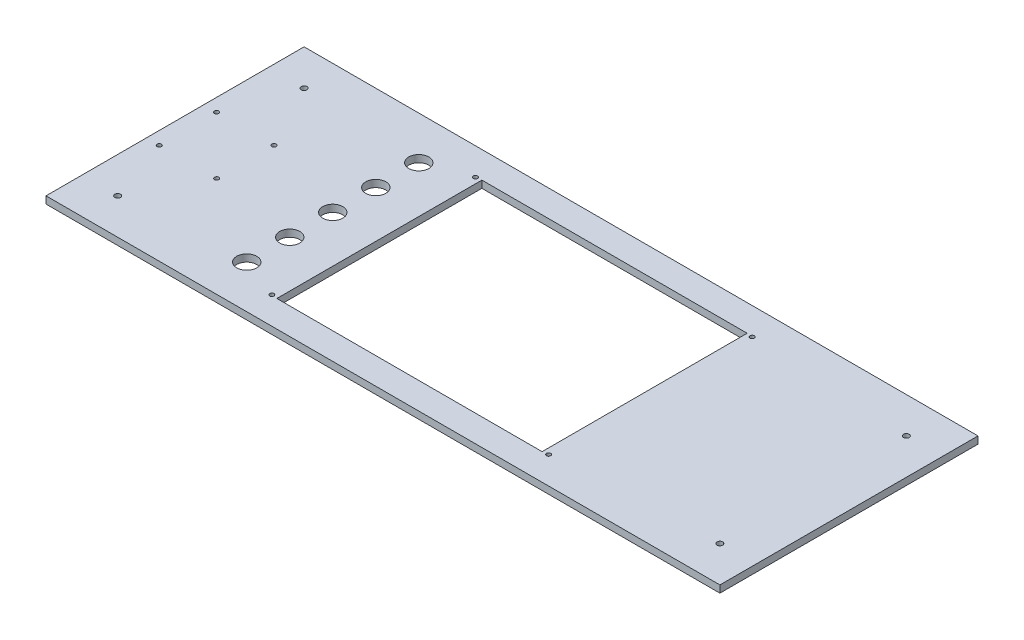
ISO-10303-21;
HEADER;
FILE_DESCRIPTION(('STEP AP214'),'2;1');
FILE_NAME('part.step','',(''),(''),'','','');
FILE_SCHEMA(('AUTOMOTIVE_DESIGN { 1 0 10303 214 1 1 1 1 }'));
ENDSEC;
DATA;
#1=APPLICATION_CONTEXT('core data for automotive mechanical design processes');
#2=APPLICATION_PROTOCOL_DEFINITION('international standard','automotive_design',2000,#1);
#3=PRODUCT_CONTEXT('',#1,'mechanical');
#4=PRODUCT('Part','Part','',(#3));
#5=PRODUCT_RELATED_PRODUCT_CATEGORY('part','',(#4));
#6=PRODUCT_DEFINITION_FORMATION('','',#4);
#7=PRODUCT_DEFINITION_CONTEXT('part definition',#1,'design');
#8=PRODUCT_DEFINITION('design','',#6,#7);
#9=PRODUCT_DEFINITION_SHAPE('','',#8);
#10=(LENGTH_UNIT() NAMED_UNIT(*) SI_UNIT(.MILLI.,.METRE.));
#11=(NAMED_UNIT(*) PLANE_ANGLE_UNIT() SI_UNIT($,.RADIAN.));
#12=(NAMED_UNIT(*) SI_UNIT($,.STERADIAN.) SOLID_ANGLE_UNIT());
#13=UNCERTAINTY_MEASURE_WITH_UNIT(LENGTH_MEASURE(1.E-05),#10,'distance_accuracy_value','');
#14=(GEOMETRIC_REPRESENTATION_CONTEXT(3) GLOBAL_UNCERTAINTY_ASSIGNED_CONTEXT((#13)) GLOBAL_UNIT_ASSIGNED_CONTEXT((#10,
#11,#12)) REPRESENTATION_CONTEXT('',''));
#15=CARTESIAN_POINT('',(0.,0.,0.));
#16=DIRECTION('',(0.,0.,1.));
#17=DIRECTION('',(1.,0.,0.));
#18=AXIS2_PLACEMENT_3D('',#15,#16,#17);
#19=CARTESIAN_POINT('',(0.,5.,0.));
#20=DIRECTION('',(0.,1.,0.));
#21=DIRECTION('',(0.,0.,1.));
#22=AXIS2_PLACEMENT_3D('',#19,#20,#21);
#23=PLANE('',#22);
#24=CARTESIAN_POINT('',(-125.,5.,15.0000000000011));
#25=DIRECTION('',(0.,1.,0.));
#26=DIRECTION('',(0.,0.,1.));
#27=AXIS2_PLACEMENT_3D('',#24,#25,#26);
#28=CIRCLE('',#27,6.99999999999993);
#29=CARTESIAN_POINT('',(-125.,5.,22.000000000001));
#30=VERTEX_POINT('',#29);
#31=EDGE_CURVE('E329',#30,#30,#28,.T.);
#32=ORIENTED_EDGE('',*,*,#31,.F.);
#33=EDGE_LOOP('',(#32));
#34=FACE_BOUND('',#33,.T.);
#35=CARTESIAN_POINT('',(-125.,5.,-45.0000000000011));
#36=DIRECTION('',(0.,1.,0.));
#37=DIRECTION('',(0.,0.,1.));
#38=AXIS2_PLACEMENT_3D('',#35,#36,#37);
#39=CIRCLE('',#38,6.99999999999993);
#40=CARTESIAN_POINT('',(-125.,5.,-38.0000000000011));
#41=VERTEX_POINT('',#40);
#42=EDGE_CURVE('E345',#41,#41,#39,.T.);
#43=ORIENTED_EDGE('',*,*,#42,.F.);
#44=EDGE_LOOP('',(#43));
#45=FACE_BOUND('',#44,.T.);
#46=CARTESIAN_POINT('',(-96.4999999999985,5.,56.));
#47=DIRECTION('',(0.,1.,0.));
#48=DIRECTION('',(0.,0.,1.));
#49=AXIS2_PLACEMENT_3D('',#46,#47,#48);
#50=CIRCLE('',#49,1.5);
#51=CARTESIAN_POINT('',(-96.4999999999985,5.,57.5));
#52=VERTEX_POINT('',#51);
#53=EDGE_CURVE('E361',#52,#52,#50,.T.);
#54=ORIENTED_EDGE('',*,*,#53,.F.);
#55=EDGE_LOOP('',(#54));
#56=FACE_BOUND('',#55,.T.);
#57=CARTESIAN_POINT('',(96.5,5.,-86.));
#58=DIRECTION('',(0.,1.,0.));
#59=DIRECTION('',(0.,0.,1.));
#60=AXIS2_PLACEMENT_3D('',#57,#58,#59);
#61=CIRCLE('',#60,1.5);
#62=CARTESIAN_POINT('',(96.5,5.,-84.5));
#63=VERTEX_POINT('',#62);
#64=EDGE_CURVE('E377',#63,#63,#61,.T.);
#65=ORIENTED_EDGE('',*,*,#64,.F.);
#66=EDGE_LOOP('',(#65));
#67=FACE_BOUND('',#66,.T.);
#68=CARTESIAN_POINT('',(210.,5.,-80.));
#69=DIRECTION('',(0.,1.,0.));
#70=DIRECTION('',(0.,0.,1.));
#71=AXIS2_PLACEMENT_3D('',#68,#69,#70);
#72=CIRCLE('',#71,2.);
#73=CARTESIAN_POINT('',(210.,5.,-78.));
#74=VERTEX_POINT('',#73);
#75=EDGE_CURVE('E393',#74,#74,#72,.T.);
#76=ORIENTED_EDGE('',*,*,#75,.F.);
#77=EDGE_LOOP('',(#76));
#78=FACE_BOUND('',#77,.T.);
#79=CARTESIAN_POINT('',(210.,5.,50.));
#80=DIRECTION('',(0.,1.,0.));
#81=DIRECTION('',(0.,0.,1.));
#82=AXIS2_PLACEMENT_3D('',#79,#80,#81);
#83=CIRCLE('',#82,2.);
#84=CARTESIAN_POINT('',(210.,5.,52.));
#85=VERTEX_POINT('',#84);
#86=EDGE_CURVE('E409',#85,#85,#83,.T.);
#87=ORIENTED_EDGE('',*,*,#86,.F.);
#88=EDGE_LOOP('',(#87));
#89=FACE_BOUND('',#88,.T.);
#90=CARTESIAN_POINT('',(-226.,5.,5.));
#91=DIRECTION('',(0.,1.,0.));
#92=DIRECTION('',(0.,0.,1.));
#93=AXIS2_PLACEMENT_3D('',#90,#91,#92);
#94=CIRCLE('',#93,1.5);
#95=CARTESIAN_POINT('',(-226.,5.,6.5));
#96=VERTEX_POINT('',#95);
#97=EDGE_CURVE('E425',#96,#96,#94,.T.);
#98=ORIENTED_EDGE('',*,*,#97,.F.);
#99=EDGE_LOOP('',(#98));
#100=FACE_BOUND('',#99,.T.);
#101=CARTESIAN_POINT('',(-186.,5.,-35.));
#102=DIRECTION('',(0.,1.,0.));
#103=DIRECTION('',(0.,0.,1.));
#104=AXIS2_PLACEMENT_3D('',#101,#102,#103);
#105=CIRCLE('',#104,1.5);
#106=CARTESIAN_POINT('',(-186.,5.,-33.5));
#107=VERTEX_POINT('',#106);
#108=EDGE_CURVE('E441',#107,#107,#105,.T.);
#109=ORIENTED_EDGE('',*,*,#108,.F.);
#110=EDGE_LOOP('',(#109));
#111=FACE_BOUND('',#110,.T.);
#112=DIRECTION('',(1.,0.,0.));
#113=VECTOR('',#112,1.);
#114=CARTESIAN_POINT('',(-92.5,5.,56.5));
#115=LINE('',#114,#113);
#116=CARTESIAN_POINT('',(-92.5,5.,56.5));
#117=VERTEX_POINT('',#116);
#118=CARTESIAN_POINT('',(92.5,5.,56.5));
#119=VERTEX_POINT('',#118);
#120=EDGE_CURVE('E114',#117,#119,#115,.T.);
#121=ORIENTED_EDGE('',*,*,#120,.F.);
#122=DIRECTION('',(0.,0.,1.));
#123=VECTOR('',#122,1.);
#124=CARTESIAN_POINT('',(-92.5,5.,-86.5));
#125=LINE('',#124,#123);
#126=CARTESIAN_POINT('',(-92.5,5.,-86.5));
#127=VERTEX_POINT('',#126);
#128=EDGE_CURVE('E105',#127,#117,#125,.T.);
#129=ORIENTED_EDGE('',*,*,#128,.F.);
#130=DIRECTION('',(-1.,0.,0.));
#131=VECTOR('',#130,1.);
#132=CARTESIAN_POINT('',(-92.5,5.,-86.5));
#133=LINE('',#132,#131);
#134=CARTESIAN_POINT('',(92.5,5.,-86.5));
#135=VERTEX_POINT('',#134);
#136=EDGE_CURVE('E132',#135,#127,#133,.T.);
#137=ORIENTED_EDGE('',*,*,#136,.F.);
#138=DIRECTION('',(0.,0.,-1.));
#139=VECTOR('',#138,1.);
#140=CARTESIAN_POINT('',(92.5,5.,-86.5));
#141=LINE('',#140,#139);
#142=EDGE_CURVE('E128',#119,#135,#141,.T.);
#143=ORIENTED_EDGE('',*,*,#142,.F.);
#144=EDGE_LOOP('',(#121,#129,#137,#143));
#145=FACE_BOUND('',#144,.T.);
#146=DIRECTION('',(0.,0.,1.));
#147=VECTOR('',#146,1.);
#148=CARTESIAN_POINT('',(-235.,5.,-105.));
#149=LINE('',#148,#147);
#150=CARTESIAN_POINT('',(-235.,5.,-105.));
#151=VERTEX_POINT('',#150);
#152=CARTESIAN_POINT('',(-235.,5.,75.));
#153=VERTEX_POINT('',#152);
#154=EDGE_CURVE('E156',#151,#153,#149,.T.);
#155=ORIENTED_EDGE('',*,*,#154,.T.);
#156=DIRECTION('',(1.,0.,0.));
#157=VECTOR('',#156,1.);
#158=CARTESIAN_POINT('',(-235.,5.,75.));
#159=LINE('',#158,#157);
#160=CARTESIAN_POINT('',(235.,5.,75.));
#161=VERTEX_POINT('',#160);
#162=EDGE_CURVE('E160',#153,#161,#159,.T.);
#163=ORIENTED_EDGE('',*,*,#162,.T.);
#164=DIRECTION('',(0.,0.,-1.));
#165=VECTOR('',#164,1.);
#166=CARTESIAN_POINT('',(235.,5.,-105.));
#167=LINE('',#166,#165);
#168=CARTESIAN_POINT('',(235.,5.,-105.));
#169=VERTEX_POINT('',#168);
#170=EDGE_CURVE('E164',#161,#169,#167,.T.);
#171=ORIENTED_EDGE('',*,*,#170,.T.);
#172=DIRECTION('',(-1.,0.,0.));
#173=VECTOR('',#172,1.);
#174=CARTESIAN_POINT('',(-235.,5.,-105.));
#175=LINE('',#174,#173);
#176=EDGE_CURVE('E167',#169,#151,#175,.T.);
#177=ORIENTED_EDGE('',*,*,#176,.T.);
#178=EDGE_LOOP('',(#155,#163,#171,#177));
#179=FACE_BOUND('',#178,.T.);
#180=CARTESIAN_POINT('',(-226.,5.,-35.));
#181=DIRECTION('',(0.,1.,0.));
#182=DIRECTION('',(0.,0.,1.));
#183=AXIS2_PLACEMENT_3D('',#180,#181,#182);
#184=CIRCLE('',#183,1.5);
#185=CARTESIAN_POINT('',(-226.,5.,-33.5));
#186=VERTEX_POINT('',#185);
#187=EDGE_CURVE('E140',#186,#186,#184,.T.);
#188=ORIENTED_EDGE('',*,*,#187,.F.);
#189=EDGE_LOOP('',(#188));
#190=FACE_BOUND('',#189,.T.);
#191=CARTESIAN_POINT('',(-186.,5.,5.));
#192=DIRECTION('',(0.,1.,0.));
#193=DIRECTION('',(0.,0.,1.));
#194=AXIS2_PLACEMENT_3D('',#191,#192,#193);
#195=CIRCLE('',#194,1.5);
#196=CARTESIAN_POINT('',(-186.,5.,6.5));
#197=VERTEX_POINT('',#196);
#198=EDGE_CURVE('E433',#197,#197,#195,.T.);
#199=ORIENTED_EDGE('',*,*,#198,.F.);
#200=EDGE_LOOP('',(#199));
#201=FACE_BOUND('',#200,.T.);
#202=CARTESIAN_POINT('',(-210.,5.,50.));
#203=DIRECTION('',(0.,1.,0.));
#204=DIRECTION('',(0.,0.,1.));
#205=AXIS2_PLACEMENT_3D('',#202,#203,#204);
#206=CIRCLE('',#205,2.);
#207=CARTESIAN_POINT('',(-210.,5.,52.));
#208=VERTEX_POINT('',#207);
#209=EDGE_CURVE('E417',#208,#208,#206,.T.);
#210=ORIENTED_EDGE('',*,*,#209,.F.);
#211=EDGE_LOOP('',(#210));
#212=FACE_BOUND('',#211,.T.);
#213=CARTESIAN_POINT('',(-210.,5.,-80.));
#214=DIRECTION('',(0.,1.,0.));
#215=DIRECTION('',(0.,0.,1.));
#216=AXIS2_PLACEMENT_3D('',#213,#214,#215);
#217=CIRCLE('',#216,2.);
#218=CARTESIAN_POINT('',(-210.,5.,-78.));
#219=VERTEX_POINT('',#218);
#220=EDGE_CURVE('E401',#219,#219,#217,.T.);
#221=ORIENTED_EDGE('',*,*,#220,.F.);
#222=EDGE_LOOP('',(#221));
#223=FACE_BOUND('',#222,.T.);
#224=CARTESIAN_POINT('',(-96.5,5.,-86.));
#225=DIRECTION('',(0.,1.,0.));
#226=DIRECTION('',(0.,0.,1.));
#227=AXIS2_PLACEMENT_3D('',#224,#225,#226);
#228=CIRCLE('',#227,1.5);
#229=CARTESIAN_POINT('',(-96.5,5.,-84.5));
#230=VERTEX_POINT('',#229);
#231=EDGE_CURVE('E385',#230,#230,#228,.T.);
#232=ORIENTED_EDGE('',*,*,#231,.F.);
#233=EDGE_LOOP('',(#232));
#234=FACE_BOUND('',#233,.T.);
#235=CARTESIAN_POINT('',(96.5000000000015,5.,56.));
#236=DIRECTION('',(0.,1.,0.));
#237=DIRECTION('',(0.,0.,1.));
#238=AXIS2_PLACEMENT_3D('',#235,#236,#237);
#239=CIRCLE('',#238,1.5);
#240=CARTESIAN_POINT('',(96.5000000000015,5.,57.5));
#241=VERTEX_POINT('',#240);
#242=EDGE_CURVE('E369',#241,#241,#239,.T.);
#243=ORIENTED_EDGE('',*,*,#242,.F.);
#244=EDGE_LOOP('',(#243));
#245=FACE_BOUND('',#244,.T.);
#246=CARTESIAN_POINT('',(-125.000000000001,5.,-75.0000000000021));
#247=DIRECTION('',(0.,1.,0.));
#248=DIRECTION('',(0.,0.,1.));
#249=AXIS2_PLACEMENT_3D('',#246,#247,#248);
#250=CIRCLE('',#249,6.99999999999993);
#251=CARTESIAN_POINT('',(-125.000000000001,5.,-68.0000000000022));
#252=VERTEX_POINT('',#251);
#253=EDGE_CURVE('E353',#252,#252,#250,.T.);
#254=ORIENTED_EDGE('',*,*,#253,.F.);
#255=EDGE_LOOP('',(#254));
#256=FACE_BOUND('',#255,.T.);
#257=CARTESIAN_POINT('',(-125.,5.,-15.));
#258=DIRECTION('',(0.,1.,0.));
#259=DIRECTION('',(0.,0.,1.));
#260=AXIS2_PLACEMENT_3D('',#257,#258,#259);
#261=CIRCLE('',#260,6.99999999999987);
#262=CARTESIAN_POINT('',(-125.,5.,-8.00000000000013));
#263=VERTEX_POINT('',#262);
#264=EDGE_CURVE('E337',#263,#263,#261,.T.);
#265=ORIENTED_EDGE('',*,*,#264,.F.);
#266=EDGE_LOOP('',(#265));
#267=FACE_BOUND('',#266,.T.);
#268=CARTESIAN_POINT('',(-124.999999999999,5.,45.0000000000021));
#269=DIRECTION('',(0.,1.,0.));
#270=DIRECTION('',(0.,0.,1.));
#271=AXIS2_PLACEMENT_3D('',#268,#269,#270);
#272=CIRCLE('',#271,6.99999999999993);
#273=CARTESIAN_POINT('',(-124.999999999999,5.,52.0000000000021));
#274=VERTEX_POINT('',#273);
#275=EDGE_CURVE('E318',#274,#274,#272,.T.);
#276=ORIENTED_EDGE('',*,*,#275,.F.);
#277=EDGE_LOOP('',(#276));
#278=FACE_BOUND('',#277,.T.);
#279=ADVANCED_FACE('F39',(#34,#45,#56,#67,#78,#89,#100,#111,#145,#179,#190,#201,#212,#223,#234,
#245,#256,#267,#278),#23,.T.);
#280=CARTESIAN_POINT('',(0.,0.,0.));
#281=DIRECTION('',(0.,1.,0.));
#282=DIRECTION('',(0.,0.,1.));
#283=AXIS2_PLACEMENT_3D('',#280,#281,#282);
#284=PLANE('',#283);
#285=DIRECTION('',(0.,0.,1.));
#286=VECTOR('',#285,1.);
#287=CARTESIAN_POINT('',(-235.,0.,-105.));
#288=LINE('',#287,#286);
#289=CARTESIAN_POINT('',(-235.,0.,-105.));
#290=VERTEX_POINT('',#289);
#291=CARTESIAN_POINT('',(-235.,0.,75.));
#292=VERTEX_POINT('',#291);
#293=EDGE_CURVE('E123',#290,#292,#288,.T.);
#294=ORIENTED_EDGE('',*,*,#293,.F.);
#295=DIRECTION('',(-1.,0.,0.));
#296=VECTOR('',#295,1.);
#297=CARTESIAN_POINT('',(-235.,0.,-105.));
#298=LINE('',#297,#296);
#299=CARTESIAN_POINT('',(235.,0.,-105.));
#300=VERTEX_POINT('',#299);
#301=EDGE_CURVE('E161',#300,#290,#298,.T.);
#302=ORIENTED_EDGE('',*,*,#301,.F.);
#303=DIRECTION('',(0.,0.,-1.));
#304=VECTOR('',#303,1.);
#305=CARTESIAN_POINT('',(235.,0.,-105.));
#306=LINE('',#305,#304);
#307=CARTESIAN_POINT('',(235.,0.,75.));
#308=VERTEX_POINT('',#307);
#309=EDGE_CURVE('E177',#308,#300,#306,.T.);
#310=ORIENTED_EDGE('',*,*,#309,.F.);
#311=DIRECTION('',(1.,0.,0.));
#312=VECTOR('',#311,1.);
#313=CARTESIAN_POINT('',(-235.,0.,75.));
#314=LINE('',#313,#312);
#315=EDGE_CURVE('E174',#292,#308,#314,.T.);
#316=ORIENTED_EDGE('',*,*,#315,.F.);
#317=EDGE_LOOP('',(#294,#302,#310,#316));
#318=FACE_BOUND('',#317,.T.);
#319=DIRECTION('',(0.,0.,1.));
#320=VECTOR('',#319,1.);
#321=CARTESIAN_POINT('',(-92.5,0.,-86.5));
#322=LINE('',#321,#320);
#323=CARTESIAN_POINT('',(-92.5,0.,-86.5));
#324=VERTEX_POINT('',#323);
#325=CARTESIAN_POINT('',(-92.5,0.,56.5));
#326=VERTEX_POINT('',#325);
#327=EDGE_CURVE('E63',#324,#326,#322,.T.);
#328=ORIENTED_EDGE('',*,*,#327,.T.);
#329=DIRECTION('',(1.,0.,0.));
#330=VECTOR('',#329,1.);
#331=CARTESIAN_POINT('',(-92.5,0.,56.5));
#332=LINE('',#331,#330);
#333=CARTESIAN_POINT('',(92.5,0.,56.5));
#334=VERTEX_POINT('',#333);
#335=EDGE_CURVE('E121',#326,#334,#332,.T.);
#336=ORIENTED_EDGE('',*,*,#335,.T.);
#337=DIRECTION('',(0.,0.,-1.));
#338=VECTOR('',#337,1.);
#339=CARTESIAN_POINT('',(92.5,0.,-86.5));
#340=LINE('',#339,#338);
#341=CARTESIAN_POINT('',(92.5,0.,-86.5));
#342=VERTEX_POINT('',#341);
#343=EDGE_CURVE('E143',#334,#342,#340,.T.);
#344=ORIENTED_EDGE('',*,*,#343,.T.);
#345=DIRECTION('',(-1.,0.,0.));
#346=VECTOR('',#345,1.);
#347=CARTESIAN_POINT('',(-92.5,0.,-86.5));
#348=LINE('',#347,#346);
#349=EDGE_CURVE('E115',#342,#324,#348,.T.);
#350=ORIENTED_EDGE('',*,*,#349,.T.);
#351=EDGE_LOOP('',(#328,#336,#344,#350));
#352=FACE_BOUND('',#351,.T.);
#353=CARTESIAN_POINT('',(-226.,0.,-35.));
#354=DIRECTION('',(0.,1.,0.));
#355=DIRECTION('',(0.,0.,1.));
#356=AXIS2_PLACEMENT_3D('',#353,#354,#355);
#357=CIRCLE('',#356,1.5);
#358=CARTESIAN_POINT('',(-226.,0.,-33.5));
#359=VERTEX_POINT('',#358);
#360=EDGE_CURVE('E445',#359,#359,#357,.T.);
#361=ORIENTED_EDGE('',*,*,#360,.T.);
#362=EDGE_LOOP('',(#361));
#363=FACE_BOUND('',#362,.T.);
#364=CARTESIAN_POINT('',(-186.,0.,-35.));
#365=DIRECTION('',(0.,1.,0.));
#366=DIRECTION('',(0.,0.,1.));
#367=AXIS2_PLACEMENT_3D('',#364,#365,#366);
#368=CIRCLE('',#367,1.5);
#369=CARTESIAN_POINT('',(-186.,0.,-33.5));
#370=VERTEX_POINT('',#369);
#371=EDGE_CURVE('E437',#370,#370,#368,.T.);
#372=ORIENTED_EDGE('',*,*,#371,.T.);
#373=EDGE_LOOP('',(#372));
#374=FACE_BOUND('',#373,.T.);
#375=CARTESIAN_POINT('',(-186.,0.,5.));
#376=DIRECTION('',(0.,1.,0.));
#377=DIRECTION('',(0.,0.,1.));
#378=AXIS2_PLACEMENT_3D('',#375,#376,#377);
#379=CIRCLE('',#378,1.5);
#380=CARTESIAN_POINT('',(-186.,0.,6.5));
#381=VERTEX_POINT('',#380);
#382=EDGE_CURVE('E429',#381,#381,#379,.T.);
#383=ORIENTED_EDGE('',*,*,#382,.T.);
#384=EDGE_LOOP('',(#383));
#385=FACE_BOUND('',#384,.T.);
#386=CARTESIAN_POINT('',(-226.,0.,5.));
#387=DIRECTION('',(0.,1.,0.));
#388=DIRECTION('',(0.,0.,1.));
#389=AXIS2_PLACEMENT_3D('',#386,#387,#388);
#390=CIRCLE('',#389,1.5);
#391=CARTESIAN_POINT('',(-226.,0.,6.5));
#392=VERTEX_POINT('',#391);
#393=EDGE_CURVE('E421',#392,#392,#390,.T.);
#394=ORIENTED_EDGE('',*,*,#393,.T.);
#395=EDGE_LOOP('',(#394));
#396=FACE_BOUND('',#395,.T.);
#397=CARTESIAN_POINT('',(-210.,0.,50.));
#398=DIRECTION('',(0.,1.,0.));
#399=DIRECTION('',(0.,0.,1.));
#400=AXIS2_PLACEMENT_3D('',#397,#398,#399);
#401=CIRCLE('',#400,2.);
#402=CARTESIAN_POINT('',(-210.,0.,52.));
#403=VERTEX_POINT('',#402);
#404=EDGE_CURVE('E413',#403,#403,#401,.T.);
#405=ORIENTED_EDGE('',*,*,#404,.T.);
#406=EDGE_LOOP('',(#405));
#407=FACE_BOUND('',#406,.T.);
#408=CARTESIAN_POINT('',(210.,0.,50.));
#409=DIRECTION('',(0.,1.,0.));
#410=DIRECTION('',(0.,0.,1.));
#411=AXIS2_PLACEMENT_3D('',#408,#409,#410);
#412=CIRCLE('',#411,2.);
#413=CARTESIAN_POINT('',(210.,0.,52.));
#414=VERTEX_POINT('',#413);
#415=EDGE_CURVE('E405',#414,#414,#412,.T.);
#416=ORIENTED_EDGE('',*,*,#415,.T.);
#417=EDGE_LOOP('',(#416));
#418=FACE_BOUND('',#417,.T.);
#419=CARTESIAN_POINT('',(-210.,0.,-80.));
#420=DIRECTION('',(0.,1.,0.));
#421=DIRECTION('',(0.,0.,1.));
#422=AXIS2_PLACEMENT_3D('',#419,#420,#421);
#423=CIRCLE('',#422,2.);
#424=CARTESIAN_POINT('',(-210.,0.,-78.));
#425=VERTEX_POINT('',#424);
#426=EDGE_CURVE('E397',#425,#425,#423,.T.);
#427=ORIENTED_EDGE('',*,*,#426,.T.);
#428=EDGE_LOOP('',(#427));
#429=FACE_BOUND('',#428,.T.);
#430=CARTESIAN_POINT('',(210.,0.,-80.));
#431=DIRECTION('',(0.,1.,0.));
#432=DIRECTION('',(0.,0.,1.));
#433=AXIS2_PLACEMENT_3D('',#430,#431,#432);
#434=CIRCLE('',#433,2.);
#435=CARTESIAN_POINT('',(210.,0.,-78.));
#436=VERTEX_POINT('',#435);
#437=EDGE_CURVE('E389',#436,#436,#434,.T.);
#438=ORIENTED_EDGE('',*,*,#437,.T.);
#439=EDGE_LOOP('',(#438));
#440=FACE_BOUND('',#439,.T.);
#441=CARTESIAN_POINT('',(-96.5,0.,-86.));
#442=DIRECTION('',(0.,1.,0.));
#443=DIRECTION('',(0.,0.,1.));
#444=AXIS2_PLACEMENT_3D('',#441,#442,#443);
#445=CIRCLE('',#444,1.5);
#446=CARTESIAN_POINT('',(-96.5,0.,-84.5));
#447=VERTEX_POINT('',#446);
#448=EDGE_CURVE('E381',#447,#447,#445,.T.);
#449=ORIENTED_EDGE('',*,*,#448,.T.);
#450=EDGE_LOOP('',(#449));
#451=FACE_BOUND('',#450,.T.);
#452=CARTESIAN_POINT('',(96.5,0.,-86.));
#453=DIRECTION('',(0.,1.,0.));
#454=DIRECTION('',(0.,0.,1.));
#455=AXIS2_PLACEMENT_3D('',#452,#453,#454);
#456=CIRCLE('',#455,1.5);
#457=CARTESIAN_POINT('',(96.5,0.,-84.5));
#458=VERTEX_POINT('',#457);
#459=EDGE_CURVE('E373',#458,#458,#456,.T.);
#460=ORIENTED_EDGE('',*,*,#459,.T.);
#461=EDGE_LOOP('',(#460));
#462=FACE_BOUND('',#461,.T.);
#463=CARTESIAN_POINT('',(96.5000000000015,0.,56.));
#464=DIRECTION('',(0.,1.,0.));
#465=DIRECTION('',(0.,0.,1.));
#466=AXIS2_PLACEMENT_3D('',#463,#464,#465);
#467=CIRCLE('',#466,1.5);
#468=CARTESIAN_POINT('',(96.5000000000015,0.,57.5));
#469=VERTEX_POINT('',#468);
#470=EDGE_CURVE('E365',#469,#469,#467,.T.);
#471=ORIENTED_EDGE('',*,*,#470,.T.);
#472=EDGE_LOOP('',(#471));
#473=FACE_BOUND('',#472,.T.);
#474=CARTESIAN_POINT('',(-96.4999999999985,0.,56.));
#475=DIRECTION('',(0.,1.,0.));
#476=DIRECTION('',(0.,0.,1.));
#477=AXIS2_PLACEMENT_3D('',#474,#475,#476);
#478=CIRCLE('',#477,1.5);
#479=CARTESIAN_POINT('',(-96.4999999999985,0.,57.5));
#480=VERTEX_POINT('',#479);
#481=EDGE_CURVE('E357',#480,#480,#478,.T.);
#482=ORIENTED_EDGE('',*,*,#481,.T.);
#483=EDGE_LOOP('',(#482));
#484=FACE_BOUND('',#483,.T.);
#485=CARTESIAN_POINT('',(-125.000000000001,0.,-75.0000000000021));
#486=DIRECTION('',(0.,1.,0.));
#487=DIRECTION('',(0.,0.,1.));
#488=AXIS2_PLACEMENT_3D('',#485,#486,#487);
#489=CIRCLE('',#488,6.99999999999993);
#490=CARTESIAN_POINT('',(-125.000000000001,0.,-68.0000000000022));
#491=VERTEX_POINT('',#490);
#492=EDGE_CURVE('E349',#491,#491,#489,.T.);
#493=ORIENTED_EDGE('',*,*,#492,.T.);
#494=EDGE_LOOP('',(#493));
#495=FACE_BOUND('',#494,.T.);
#496=CARTESIAN_POINT('',(-125.,0.,-45.0000000000011));
#497=DIRECTION('',(0.,1.,0.));
#498=DIRECTION('',(0.,0.,1.));
#499=AXIS2_PLACEMENT_3D('',#496,#497,#498);
#500=CIRCLE('',#499,6.99999999999993);
#501=CARTESIAN_POINT('',(-125.,0.,-38.0000000000011));
#502=VERTEX_POINT('',#501);
#503=EDGE_CURVE('E341',#502,#502,#500,.T.);
#504=ORIENTED_EDGE('',*,*,#503,.T.);
#505=EDGE_LOOP('',(#504));
#506=FACE_BOUND('',#505,.T.);
#507=CARTESIAN_POINT('',(-125.,0.,-15.));
#508=DIRECTION('',(0.,1.,0.));
#509=DIRECTION('',(0.,0.,1.));
#510=AXIS2_PLACEMENT_3D('',#507,#508,#509);
#511=CIRCLE('',#510,6.99999999999987);
#512=CARTESIAN_POINT('',(-125.,0.,-8.00000000000013));
#513=VERTEX_POINT('',#512);
#514=EDGE_CURVE('E333',#513,#513,#511,.T.);
#515=ORIENTED_EDGE('',*,*,#514,.T.);
#516=EDGE_LOOP('',(#515));
#517=FACE_BOUND('',#516,.T.);
#518=CARTESIAN_POINT('',(-125.,0.,15.0000000000011));
#519=DIRECTION('',(0.,1.,0.));
#520=DIRECTION('',(0.,0.,1.));
#521=AXIS2_PLACEMENT_3D('',#518,#519,#520);
#522=CIRCLE('',#521,6.99999999999993);
#523=CARTESIAN_POINT('',(-125.,0.,22.000000000001));
#524=VERTEX_POINT('',#523);
#525=EDGE_CURVE('E326',#524,#524,#522,.T.);
#526=ORIENTED_EDGE('',*,*,#525,.T.);
#527=EDGE_LOOP('',(#526));
#528=FACE_BOUND('',#527,.T.);
#529=CARTESIAN_POINT('',(-124.999999999999,0.,45.0000000000021));
#530=DIRECTION('',(0.,1.,0.));
#531=DIRECTION('',(0.,0.,1.));
#532=AXIS2_PLACEMENT_3D('',#529,#530,#531);
#533=CIRCLE('',#532,6.99999999999993);
#534=CARTESIAN_POINT('',(-124.999999999999,0.,52.0000000000021));
#535=VERTEX_POINT('',#534);
#536=EDGE_CURVE('E321',#535,#535,#533,.T.);
#537=ORIENTED_EDGE('',*,*,#536,.T.);
#538=EDGE_LOOP('',(#537));
#539=FACE_BOUND('',#538,.T.);
#540=ADVANCED_FACE('F200',(#318,#352,#363,#374,#385,#396,#407,#418,#429,#440,#451,#462,#473,
#484,#495,#506,#517,#528,#539),#284,.F.);
#541=CARTESIAN_POINT('',(-235.,5.,-105.));
#542=DIRECTION('',(1.,0.,0.));
#543=DIRECTION('',(0.,0.,-1.));
#544=AXIS2_PLACEMENT_3D('',#541,#542,#543);
#545=PLANE('',#544);
#546=ORIENTED_EDGE('',*,*,#293,.T.);
#547=DIRECTION('',(0.,-1.,0.));
#548=VECTOR('',#547,1.);
#549=CARTESIAN_POINT('',(-235.,5.,75.));
#550=LINE('',#549,#548);
#551=EDGE_CURVE('E11',#153,#292,#550,.T.);
#552=ORIENTED_EDGE('',*,*,#551,.F.);
#553=ORIENTED_EDGE('',*,*,#154,.F.);
#554=DIRECTION('',(0.,-1.,0.));
#555=VECTOR('',#554,1.);
#556=CARTESIAN_POINT('',(-235.,5.,-105.));
#557=LINE('',#556,#555);
#558=EDGE_CURVE('E170',#151,#290,#557,.T.);
#559=ORIENTED_EDGE('',*,*,#558,.T.);
#560=EDGE_LOOP('',(#546,#552,#553,#559));
#561=FACE_BOUND('',#560,.T.);
#562=ADVANCED_FACE('F41',(#561),#545,.F.);
#563=CARTESIAN_POINT('',(-235.,5.,75.));
#564=DIRECTION('',(0.,0.,-1.));
#565=DIRECTION('',(-1.,0.,0.));
#566=AXIS2_PLACEMENT_3D('',#563,#564,#565);
#567=PLANE('',#566);
#568=ORIENTED_EDGE('',*,*,#315,.T.);
#569=DIRECTION('',(0.,-1.,0.));
#570=VECTOR('',#569,1.);
#571=CARTESIAN_POINT('',(235.,5.,75.));
#572=LINE('',#571,#570);
#573=EDGE_CURVE('E48',#161,#308,#572,.T.);
#574=ORIENTED_EDGE('',*,*,#573,.F.);
#575=ORIENTED_EDGE('',*,*,#162,.F.);
#576=ORIENTED_EDGE('',*,*,#551,.T.);
#577=EDGE_LOOP('',(#568,#574,#575,#576));
#578=FACE_BOUND('',#577,.T.);
#579=ADVANCED_FACE('F210',(#578),#567,.F.);
#580=CARTESIAN_POINT('',(235.,5.,-105.));
#581=DIRECTION('',(-1.,0.,0.));
#582=DIRECTION('',(0.,0.,1.));
#583=AXIS2_PLACEMENT_3D('',#580,#581,#582);
#584=PLANE('',#583);
#585=ORIENTED_EDGE('',*,*,#309,.T.);
#586=DIRECTION('',(0.,-1.,0.));
#587=VECTOR('',#586,1.);
#588=CARTESIAN_POINT('',(235.,5.,-105.));
#589=LINE('',#588,#587);
#590=EDGE_CURVE('E185',#169,#300,#589,.T.);
#591=ORIENTED_EDGE('',*,*,#590,.F.);
#592=ORIENTED_EDGE('',*,*,#170,.F.);
#593=ORIENTED_EDGE('',*,*,#573,.T.);
#594=EDGE_LOOP('',(#585,#591,#592,#593));
#595=FACE_BOUND('',#594,.T.);
#596=ADVANCED_FACE('F194',(#595),#584,.F.);
#597=CARTESIAN_POINT('',(-235.,5.,-105.));
#598=DIRECTION('',(0.,0.,1.));
#599=DIRECTION('',(1.,0.,0.));
#600=AXIS2_PLACEMENT_3D('',#597,#598,#599);
#601=PLANE('',#600);
#602=ORIENTED_EDGE('',*,*,#301,.T.);
#603=ORIENTED_EDGE('',*,*,#558,.F.);
#604=ORIENTED_EDGE('',*,*,#176,.F.);
#605=ORIENTED_EDGE('',*,*,#590,.T.);
#606=EDGE_LOOP('',(#602,#603,#604,#605));
#607=FACE_BOUND('',#606,.T.);
#608=ADVANCED_FACE('F204',(#607),#601,.F.);
#609=CARTESIAN_POINT('',(-92.5,5.,-86.5));
#610=DIRECTION('',(1.,0.,0.));
#611=DIRECTION('',(0.,0.,-1.));
#612=AXIS2_PLACEMENT_3D('',#609,#610,#611);
#613=PLANE('',#612);
#614=ORIENTED_EDGE('',*,*,#327,.F.);
#615=DIRECTION('',(0.,-1.,0.));
#616=VECTOR('',#615,1.);
#617=CARTESIAN_POINT('',(-92.5,5.,-86.5));
#618=LINE('',#617,#616);
#619=EDGE_CURVE('E109',#127,#324,#618,.T.);
#620=ORIENTED_EDGE('',*,*,#619,.F.);
#621=ORIENTED_EDGE('',*,*,#128,.T.);
#622=DIRECTION('',(0.,-1.,0.));
#623=VECTOR('',#622,1.);
#624=CARTESIAN_POINT('',(-92.5,5.,56.5));
#625=LINE('',#624,#623);
#626=EDGE_CURVE('E108',#117,#326,#625,.T.);
#627=ORIENTED_EDGE('',*,*,#626,.T.);
#628=EDGE_LOOP('',(#614,#620,#621,#627));
#629=FACE_BOUND('',#628,.T.);
#630=ADVANCED_FACE('F107',(#629),#613,.T.);
#631=CARTESIAN_POINT('',(-92.5,5.,56.5));
#632=DIRECTION('',(0.,0.,-1.));
#633=DIRECTION('',(-1.,0.,0.));
#634=AXIS2_PLACEMENT_3D('',#631,#632,#633);
#635=PLANE('',#634);
#636=ORIENTED_EDGE('',*,*,#335,.F.);
#637=ORIENTED_EDGE('',*,*,#626,.F.);
#638=ORIENTED_EDGE('',*,*,#120,.T.);
#639=DIRECTION('',(0.,-1.,0.));
#640=VECTOR('',#639,1.);
#641=CARTESIAN_POINT('',(92.5,5.,56.5));
#642=LINE('',#641,#640);
#643=EDGE_CURVE('E124',#119,#334,#642,.T.);
#644=ORIENTED_EDGE('',*,*,#643,.T.);
#645=EDGE_LOOP('',(#636,#637,#638,#644));
#646=FACE_BOUND('',#645,.T.);
#647=ADVANCED_FACE('F118',(#646),#635,.T.);
#648=CARTESIAN_POINT('',(92.5,5.,-86.5));
#649=DIRECTION('',(-1.,0.,0.));
#650=DIRECTION('',(0.,0.,1.));
#651=AXIS2_PLACEMENT_3D('',#648,#649,#650);
#652=PLANE('',#651);
#653=ORIENTED_EDGE('',*,*,#343,.F.);
#654=ORIENTED_EDGE('',*,*,#643,.F.);
#655=ORIENTED_EDGE('',*,*,#142,.T.);
#656=DIRECTION('',(0.,-1.,0.));
#657=VECTOR('',#656,1.);
#658=CARTESIAN_POINT('',(92.5,5.,-86.5));
#659=LINE('',#658,#657);
#660=EDGE_CURVE('E55',#135,#342,#659,.T.);
#661=ORIENTED_EDGE('',*,*,#660,.T.);
#662=EDGE_LOOP('',(#653,#654,#655,#661));
#663=FACE_BOUND('',#662,.T.);
#664=ADVANCED_FACE('F236',(#663),#652,.T.);
#665=CARTESIAN_POINT('',(-92.5,5.,-86.5));
#666=DIRECTION('',(0.,0.,1.));
#667=DIRECTION('',(1.,0.,0.));
#668=AXIS2_PLACEMENT_3D('',#665,#666,#667);
#669=PLANE('',#668);
#670=ORIENTED_EDGE('',*,*,#349,.F.);
#671=ORIENTED_EDGE('',*,*,#660,.F.);
#672=ORIENTED_EDGE('',*,*,#136,.T.);
#673=ORIENTED_EDGE('',*,*,#619,.T.);
#674=EDGE_LOOP('',(#670,#671,#672,#673));
#675=FACE_BOUND('',#674,.T.);
#676=ADVANCED_FACE('F240',(#675),#669,.T.);
#677=CARTESIAN_POINT('',(-226.,5.,-35.));
#678=DIRECTION('',(0.,-1.,0.));
#679=DIRECTION('',(0.,0.,-1.));
#680=AXIS2_PLACEMENT_3D('',#677,#678,#679);
#681=CYLINDRICAL_SURFACE('',#680,1.5);
#682=ORIENTED_EDGE('',*,*,#187,.T.);
#683=EDGE_LOOP('',(#682));
#684=FACE_BOUND('',#683,.T.);
#685=ORIENTED_EDGE('',*,*,#360,.F.);
#686=EDGE_LOOP('',(#685));
#687=FACE_BOUND('',#686,.T.);
#688=ADVANCED_FACE('F246',(#684,#687),#681,.F.);
#689=CARTESIAN_POINT('',(-186.,5.,-35.));
#690=DIRECTION('',(0.,-1.,0.));
#691=DIRECTION('',(0.,0.,-1.));
#692=AXIS2_PLACEMENT_3D('',#689,#690,#691);
#693=CYLINDRICAL_SURFACE('',#692,1.5);
#694=ORIENTED_EDGE('',*,*,#108,.T.);
#695=EDGE_LOOP('',(#694));
#696=FACE_BOUND('',#695,.T.);
#697=ORIENTED_EDGE('',*,*,#371,.F.);
#698=EDGE_LOOP('',(#697));
#699=FACE_BOUND('',#698,.T.);
#700=ADVANCED_FACE('F249',(#696,#699),#693,.F.);
#701=CARTESIAN_POINT('',(-186.,5.,5.));
#702=DIRECTION('',(0.,-1.,0.));
#703=DIRECTION('',(0.,0.,-1.));
#704=AXIS2_PLACEMENT_3D('',#701,#702,#703);
#705=CYLINDRICAL_SURFACE('',#704,1.5);
#706=ORIENTED_EDGE('',*,*,#198,.T.);
#707=EDGE_LOOP('',(#706));
#708=FACE_BOUND('',#707,.T.);
#709=ORIENTED_EDGE('',*,*,#382,.F.);
#710=EDGE_LOOP('',(#709));
#711=FACE_BOUND('',#710,.T.);
#712=ADVANCED_FACE('F253',(#708,#711),#705,.F.);
#713=CARTESIAN_POINT('',(-226.,5.,5.));
#714=DIRECTION('',(0.,-1.,0.));
#715=DIRECTION('',(0.,0.,-1.));
#716=AXIS2_PLACEMENT_3D('',#713,#714,#715);
#717=CYLINDRICAL_SURFACE('',#716,1.5);
#718=ORIENTED_EDGE('',*,*,#97,.T.);
#719=EDGE_LOOP('',(#718));
#720=FACE_BOUND('',#719,.T.);
#721=ORIENTED_EDGE('',*,*,#393,.F.);
#722=EDGE_LOOP('',(#721));
#723=FACE_BOUND('',#722,.T.);
#724=ADVANCED_FACE('F257',(#720,#723),#717,.F.);
#725=CARTESIAN_POINT('',(-210.,5.,50.));
#726=DIRECTION('',(0.,-1.,0.));
#727=DIRECTION('',(0.,0.,-1.));
#728=AXIS2_PLACEMENT_3D('',#725,#726,#727);
#729=CYLINDRICAL_SURFACE('',#728,2.);
#730=ORIENTED_EDGE('',*,*,#209,.T.);
#731=EDGE_LOOP('',(#730));
#732=FACE_BOUND('',#731,.T.);
#733=ORIENTED_EDGE('',*,*,#404,.F.);
#734=EDGE_LOOP('',(#733));
#735=FACE_BOUND('',#734,.T.);
#736=ADVANCED_FACE('F261',(#732,#735),#729,.F.);
#737=CARTESIAN_POINT('',(210.,5.,50.));
#738=DIRECTION('',(0.,-1.,0.));
#739=DIRECTION('',(0.,0.,-1.));
#740=AXIS2_PLACEMENT_3D('',#737,#738,#739);
#741=CYLINDRICAL_SURFACE('',#740,2.);
#742=ORIENTED_EDGE('',*,*,#86,.T.);
#743=EDGE_LOOP('',(#742));
#744=FACE_BOUND('',#743,.T.);
#745=ORIENTED_EDGE('',*,*,#415,.F.);
#746=EDGE_LOOP('',(#745));
#747=FACE_BOUND('',#746,.T.);
#748=ADVANCED_FACE('F265',(#744,#747),#741,.F.);
#749=CARTESIAN_POINT('',(-210.,5.,-80.));
#750=DIRECTION('',(0.,-1.,0.));
#751=DIRECTION('',(0.,0.,-1.));
#752=AXIS2_PLACEMENT_3D('',#749,#750,#751);
#753=CYLINDRICAL_SURFACE('',#752,2.);
#754=ORIENTED_EDGE('',*,*,#220,.T.);
#755=EDGE_LOOP('',(#754));
#756=FACE_BOUND('',#755,.T.);
#757=ORIENTED_EDGE('',*,*,#426,.F.);
#758=EDGE_LOOP('',(#757));
#759=FACE_BOUND('',#758,.T.);
#760=ADVANCED_FACE('F269',(#756,#759),#753,.F.);
#761=CARTESIAN_POINT('',(210.,5.,-80.));
#762=DIRECTION('',(0.,-1.,0.));
#763=DIRECTION('',(0.,0.,-1.));
#764=AXIS2_PLACEMENT_3D('',#761,#762,#763);
#765=CYLINDRICAL_SURFACE('',#764,2.);
#766=ORIENTED_EDGE('',*,*,#75,.T.);
#767=EDGE_LOOP('',(#766));
#768=FACE_BOUND('',#767,.T.);
#769=ORIENTED_EDGE('',*,*,#437,.F.);
#770=EDGE_LOOP('',(#769));
#771=FACE_BOUND('',#770,.T.);
#772=ADVANCED_FACE('F273',(#768,#771),#765,.F.);
#773=CARTESIAN_POINT('',(-96.5,5.,-86.));
#774=DIRECTION('',(0.,-1.,0.));
#775=DIRECTION('',(0.,0.,-1.));
#776=AXIS2_PLACEMENT_3D('',#773,#774,#775);
#777=CYLINDRICAL_SURFACE('',#776,1.5);
#778=ORIENTED_EDGE('',*,*,#231,.T.);
#779=EDGE_LOOP('',(#778));
#780=FACE_BOUND('',#779,.T.);
#781=ORIENTED_EDGE('',*,*,#448,.F.);
#782=EDGE_LOOP('',(#781));
#783=FACE_BOUND('',#782,.T.);
#784=ADVANCED_FACE('F277',(#780,#783),#777,.F.);
#785=CARTESIAN_POINT('',(96.5,5.,-86.));
#786=DIRECTION('',(0.,-1.,0.));
#787=DIRECTION('',(0.,0.,-1.));
#788=AXIS2_PLACEMENT_3D('',#785,#786,#787);
#789=CYLINDRICAL_SURFACE('',#788,1.5);
#790=ORIENTED_EDGE('',*,*,#64,.T.);
#791=EDGE_LOOP('',(#790));
#792=FACE_BOUND('',#791,.T.);
#793=ORIENTED_EDGE('',*,*,#459,.F.);
#794=EDGE_LOOP('',(#793));
#795=FACE_BOUND('',#794,.T.);
#796=ADVANCED_FACE('F281',(#792,#795),#789,.F.);
#797=CARTESIAN_POINT('',(96.5000000000015,5.,56.));
#798=DIRECTION('',(0.,-1.,0.));
#799=DIRECTION('',(0.,0.,-1.));
#800=AXIS2_PLACEMENT_3D('',#797,#798,#799);
#801=CYLINDRICAL_SURFACE('',#800,1.5);
#802=ORIENTED_EDGE('',*,*,#242,.T.);
#803=EDGE_LOOP('',(#802));
#804=FACE_BOUND('',#803,.T.);
#805=ORIENTED_EDGE('',*,*,#470,.F.);
#806=EDGE_LOOP('',(#805));
#807=FACE_BOUND('',#806,.T.);
#808=ADVANCED_FACE('F285',(#804,#807),#801,.F.);
#809=CARTESIAN_POINT('',(-96.4999999999985,5.,56.));
#810=DIRECTION('',(0.,-1.,0.));
#811=DIRECTION('',(0.,0.,-1.));
#812=AXIS2_PLACEMENT_3D('',#809,#810,#811);
#813=CYLINDRICAL_SURFACE('',#812,1.5);
#814=ORIENTED_EDGE('',*,*,#53,.T.);
#815=EDGE_LOOP('',(#814));
#816=FACE_BOUND('',#815,.T.);
#817=ORIENTED_EDGE('',*,*,#481,.F.);
#818=EDGE_LOOP('',(#817));
#819=FACE_BOUND('',#818,.T.);
#820=ADVANCED_FACE('F289',(#816,#819),#813,.F.);
#821=CARTESIAN_POINT('',(-125.000000000001,5.,-75.0000000000021));
#822=DIRECTION('',(0.,-1.,0.));
#823=DIRECTION('',(0.,0.,-1.));
#824=AXIS2_PLACEMENT_3D('',#821,#822,#823);
#825=CYLINDRICAL_SURFACE('',#824,6.99999999999993);
#826=ORIENTED_EDGE('',*,*,#253,.T.);
#827=EDGE_LOOP('',(#826));
#828=FACE_BOUND('',#827,.T.);
#829=ORIENTED_EDGE('',*,*,#492,.F.);
#830=EDGE_LOOP('',(#829));
#831=FACE_BOUND('',#830,.T.);
#832=ADVANCED_FACE('F293',(#828,#831),#825,.F.);
#833=CARTESIAN_POINT('',(-125.,5.,-45.0000000000011));
#834=DIRECTION('',(0.,-1.,0.));
#835=DIRECTION('',(0.,0.,-1.));
#836=AXIS2_PLACEMENT_3D('',#833,#834,#835);
#837=CYLINDRICAL_SURFACE('',#836,6.99999999999993);
#838=ORIENTED_EDGE('',*,*,#42,.T.);
#839=EDGE_LOOP('',(#838));
#840=FACE_BOUND('',#839,.T.);
#841=ORIENTED_EDGE('',*,*,#503,.F.);
#842=EDGE_LOOP('',(#841));
#843=FACE_BOUND('',#842,.T.);
#844=ADVANCED_FACE('F297',(#840,#843),#837,.F.);
#845=CARTESIAN_POINT('',(-125.,5.,-15.));
#846=DIRECTION('',(0.,-1.,0.));
#847=DIRECTION('',(0.,0.,-1.));
#848=AXIS2_PLACEMENT_3D('',#845,#846,#847);
#849=CYLINDRICAL_SURFACE('',#848,6.99999999999987);
#850=ORIENTED_EDGE('',*,*,#264,.T.);
#851=EDGE_LOOP('',(#850));
#852=FACE_BOUND('',#851,.T.);
#853=ORIENTED_EDGE('',*,*,#514,.F.);
#854=EDGE_LOOP('',(#853));
#855=FACE_BOUND('',#854,.T.);
#856=ADVANCED_FACE('F301',(#852,#855),#849,.F.);
#857=CARTESIAN_POINT('',(-125.,5.,15.0000000000011));
#858=DIRECTION('',(0.,-1.,0.));
#859=DIRECTION('',(0.,0.,-1.));
#860=AXIS2_PLACEMENT_3D('',#857,#858,#859);
#861=CYLINDRICAL_SURFACE('',#860,6.99999999999993);
#862=ORIENTED_EDGE('',*,*,#31,.T.);
#863=EDGE_LOOP('',(#862));
#864=FACE_BOUND('',#863,.T.);
#865=ORIENTED_EDGE('',*,*,#525,.F.);
#866=EDGE_LOOP('',(#865));
#867=FACE_BOUND('',#866,.T.);
#868=ADVANCED_FACE('F305',(#864,#867),#861,.F.);
#869=CARTESIAN_POINT('',(-124.999999999999,5.,45.0000000000021));
#870=DIRECTION('',(0.,-1.,0.));
#871=DIRECTION('',(0.,0.,-1.));
#872=AXIS2_PLACEMENT_3D('',#869,#870,#871);
#873=CYLINDRICAL_SURFACE('',#872,6.99999999999993);
#874=ORIENTED_EDGE('',*,*,#275,.T.);
#875=EDGE_LOOP('',(#874));
#876=FACE_BOUND('',#875,.T.);
#877=ORIENTED_EDGE('',*,*,#536,.F.);
#878=EDGE_LOOP('',(#877));
#879=FACE_BOUND('',#878,.T.);
#880=ADVANCED_FACE('F309',(#876,#879),#873,.F.);
#881=CLOSED_SHELL('',(#279,#540,#562,#579,#596,#608,#630,#647,#664,#676,#688,#700,#712,#724,
#736,#748,#760,#772,#784,#796,#808,#820,#832,#844,#856,#868,#880));
#882=MANIFOLD_SOLID_BREP('B2',#881);
#883=ADVANCED_BREP_SHAPE_REPRESENTATION('',(#18,#882),#14);
#884=SHAPE_DEFINITION_REPRESENTATION(#9,#883);
ENDSEC;
END-ISO-10303-21;
